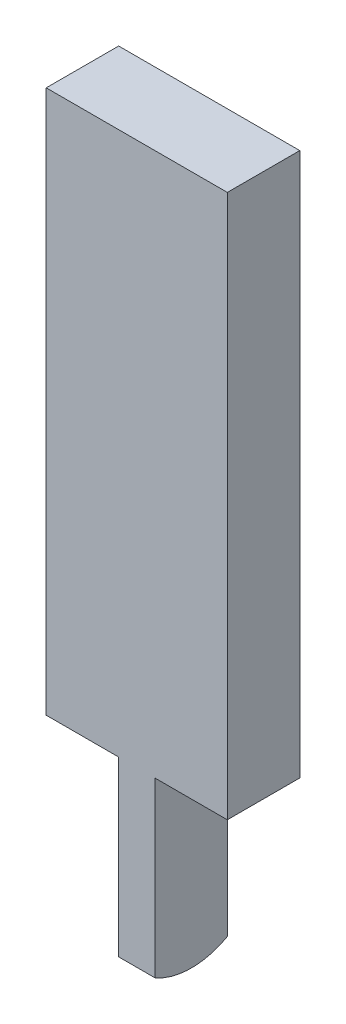
ISO-10303-21;
HEADER;
FILE_DESCRIPTION(('STEP AP214'),'2;1');
FILE_NAME('part.step','',(''),(''),'','','');
FILE_SCHEMA(('AUTOMOTIVE_DESIGN { 1 0 10303 214 1 1 1 1 }'));
ENDSEC;
DATA;
#1=APPLICATION_CONTEXT('core data for automotive mechanical design processes');
#2=APPLICATION_PROTOCOL_DEFINITION('international standard','automotive_design',2000,#1);
#3=PRODUCT_CONTEXT('',#1,'mechanical');
#4=PRODUCT('Part','Part','',(#3));
#5=PRODUCT_RELATED_PRODUCT_CATEGORY('part','',(#4));
#6=PRODUCT_DEFINITION_FORMATION('','',#4);
#7=PRODUCT_DEFINITION_CONTEXT('part definition',#1,'design');
#8=PRODUCT_DEFINITION('design','',#6,#7);
#9=PRODUCT_DEFINITION_SHAPE('','',#8);
#10=(LENGTH_UNIT() NAMED_UNIT(*) SI_UNIT(.MILLI.,.METRE.));
#11=(NAMED_UNIT(*) PLANE_ANGLE_UNIT() SI_UNIT($,.RADIAN.));
#12=(NAMED_UNIT(*) SI_UNIT($,.STERADIAN.) SOLID_ANGLE_UNIT());
#13=UNCERTAINTY_MEASURE_WITH_UNIT(LENGTH_MEASURE(1.E-05),#10,'distance_accuracy_value','');
#14=(GEOMETRIC_REPRESENTATION_CONTEXT(3) GLOBAL_UNCERTAINTY_ASSIGNED_CONTEXT((#13)) GLOBAL_UNIT_ASSIGNED_CONTEXT((#10,
#11,#12)) REPRESENTATION_CONTEXT('',''));
#15=CARTESIAN_POINT('',(0.,0.,0.));
#16=DIRECTION('',(0.,0.,1.));
#17=DIRECTION('',(1.,0.,0.));
#18=AXIS2_PLACEMENT_3D('',#15,#16,#17);
#19=CARTESIAN_POINT('',(-16.035999999991,59.,30.5000000000014));
#20=DIRECTION('',(1.,0.,0.));
#21=DIRECTION('',(0.,0.,-1.));
#22=AXIS2_PLACEMENT_3D('',#19,#20,#21);
#23=PLANE('',#22);
#24=DIRECTION('',(0.,-1.,0.));
#25=VECTOR('',#24,1.);
#26=CARTESIAN_POINT('',(-16.035999999991,59.,30.5000000000014));
#27=LINE('',#26,#25);
#28=CARTESIAN_POINT('',(-16.035999999991,59.,30.5000000000014));
#29=VERTEX_POINT('',#28);
#30=CARTESIAN_POINT('',(-16.035999999991,54.2223290948569,30.5000000000014));
#31=VERTEX_POINT('',#30);
#32=EDGE_CURVE('E46',#29,#31,#27,.T.);
#33=ORIENTED_EDGE('',*,*,#32,.T.);
#34=CARTESIAN_POINT('',(-16.035999999991,56.,31.5));
#35=DIRECTION('',(-1.,0.,0.));
#36=DIRECTION('',(0.,0.,1.));
#37=AXIS2_PLACEMENT_3D('',#34,#35,#36);
#38=CIRCLE('',#37,2.03963571428571);
#39=CARTESIAN_POINT('',(-16.035999999991,54.2223290948584,32.5000000000014));
#40=VERTEX_POINT('',#39);
#41=EDGE_CURVE('E156',#31,#40,#38,.T.);
#42=ORIENTED_EDGE('',*,*,#41,.T.);
#43=DIRECTION('',(0.,-1.,0.));
#44=VECTOR('',#43,1.);
#45=CARTESIAN_POINT('',(-16.035999999991,59.,32.5000000000014));
#46=LINE('',#45,#44);
#47=CARTESIAN_POINT('',(-16.035999999991,59.,32.5000000000014));
#48=VERTEX_POINT('',#47);
#49=EDGE_CURVE('E11',#48,#40,#46,.T.);
#50=ORIENTED_EDGE('',*,*,#49,.F.);
#51=DIRECTION('',(0.,0.,1.));
#52=VECTOR('',#51,1.);
#53=CARTESIAN_POINT('',(-16.035999999991,59.,30.5000000000014));
#54=LINE('',#53,#52);
#55=EDGE_CURVE('E152',#29,#48,#54,.T.);
#56=ORIENTED_EDGE('',*,*,#55,.F.);
#57=EDGE_LOOP('',(#33,#42,#50,#56));
#58=FACE_BOUND('',#57,.T.);
#59=ADVANCED_FACE('F30',(#58),#23,.F.);
#60=CARTESIAN_POINT('',(-16.035999999991,59.,32.5000000000014));
#61=DIRECTION('',(0.,0.,-1.));
#62=DIRECTION('',(-1.,0.,0.));
#63=AXIS2_PLACEMENT_3D('',#60,#61,#62);
#64=PLANE('',#63);
#65=ORIENTED_EDGE('',*,*,#49,.T.);
#66=DIRECTION('',(1.,0.,0.));
#67=VECTOR('',#66,1.);
#68=CARTESIAN_POINT('',(-87.9357266871828,54.2223290948584,32.5000000000014));
#69=LINE('',#68,#67);
#70=CARTESIAN_POINT('',(-15.0180000000031,54.2223290948584,32.5000000000014));
#71=VERTEX_POINT('',#70);
#72=EDGE_CURVE('E119',#40,#71,#69,.T.);
#73=ORIENTED_EDGE('',*,*,#72,.T.);
#74=DIRECTION('',(0.,-1.,0.));
#75=VECTOR('',#74,1.);
#76=CARTESIAN_POINT('',(-15.0180000000031,59.,32.5000000000014));
#77=LINE('',#76,#75);
#78=CARTESIAN_POINT('',(-15.0180000000031,59.,32.5000000000014));
#79=VERTEX_POINT('',#78);
#80=EDGE_CURVE('E38',#79,#71,#77,.T.);
#81=ORIENTED_EDGE('',*,*,#80,.F.);
#82=DIRECTION('',(1.,0.,0.));
#83=VECTOR('',#82,1.);
#84=CARTESIAN_POINT('',(-18.026999999997,59.,32.5000000000014));
#85=LINE('',#84,#83);
#86=CARTESIAN_POINT('',(-13.026999999997,59.,32.5000000000014));
#87=VERTEX_POINT('',#86);
#88=EDGE_CURVE('E150',#79,#87,#85,.T.);
#89=ORIENTED_EDGE('',*,*,#88,.T.);
#90=DIRECTION('',(0.,-1.,0.));
#91=VECTOR('',#90,1.);
#92=CARTESIAN_POINT('',(-13.026999999997,74.,32.5000000000014));
#93=LINE('',#92,#91);
#94=CARTESIAN_POINT('',(-13.026999999997,74.,32.5000000000014));
#95=VERTEX_POINT('',#94);
#96=EDGE_CURVE('E101',#95,#87,#93,.T.);
#97=ORIENTED_EDGE('',*,*,#96,.F.);
#98=DIRECTION('',(1.,0.,0.));
#99=VECTOR('',#98,1.);
#100=CARTESIAN_POINT('',(-18.026999999997,74.,32.5000000000014));
#101=LINE('',#100,#99);
#102=CARTESIAN_POINT('',(-18.026999999997,74.,32.5000000000014));
#103=VERTEX_POINT('',#102);
#104=EDGE_CURVE('E93',#103,#95,#101,.T.);
#105=ORIENTED_EDGE('',*,*,#104,.F.);
#106=DIRECTION('',(0.,-1.,0.));
#107=VECTOR('',#106,1.);
#108=CARTESIAN_POINT('',(-18.026999999997,74.,32.5000000000014));
#109=LINE('',#108,#107);
#110=CARTESIAN_POINT('',(-18.026999999997,59.,32.5000000000014));
#111=VERTEX_POINT('',#110);
#112=EDGE_CURVE('E98',#103,#111,#109,.T.);
#113=ORIENTED_EDGE('',*,*,#112,.T.);
#114=EDGE_CURVE('E178',#111,#48,#85,.T.);
#115=ORIENTED_EDGE('',*,*,#114,.T.);
#116=EDGE_LOOP('',(#65,#73,#81,#89,#97,#105,#113,#115));
#117=FACE_BOUND('',#116,.T.);
#118=ADVANCED_FACE('F95',(#117),#64,.F.);
#119=CARTESIAN_POINT('',(-15.0180000000031,59.,30.5000000000014));
#120=DIRECTION('',(-1.,0.,0.));
#121=DIRECTION('',(0.,0.,1.));
#122=AXIS2_PLACEMENT_3D('',#119,#120,#121);
#123=PLANE('',#122);
#124=ORIENTED_EDGE('',*,*,#80,.T.);
#125=CARTESIAN_POINT('',(-15.0180000000031,56.,31.5));
#126=DIRECTION('',(1.,0.,0.));
#127=DIRECTION('',(0.,0.,-1.));
#128=AXIS2_PLACEMENT_3D('',#125,#126,#127);
#129=CIRCLE('',#128,2.03963571428571);
#130=CARTESIAN_POINT('',(-15.0180000000031,54.2223290948569,30.5000000000014));
#131=VERTEX_POINT('',#130);
#132=EDGE_CURVE('E121',#71,#131,#129,.T.);
#133=ORIENTED_EDGE('',*,*,#132,.T.);
#134=DIRECTION('',(0.,-1.,0.));
#135=VECTOR('',#134,1.);
#136=CARTESIAN_POINT('',(-15.0180000000031,59.,30.5000000000014));
#137=LINE('',#136,#135);
#138=CARTESIAN_POINT('',(-15.0180000000031,59.,30.5000000000014));
#139=VERTEX_POINT('',#138);
#140=EDGE_CURVE('E154',#139,#131,#137,.T.);
#141=ORIENTED_EDGE('',*,*,#140,.F.);
#142=DIRECTION('',(0.,0.,-1.));
#143=VECTOR('',#142,1.);
#144=CARTESIAN_POINT('',(-15.0180000000031,59.,30.5000000000014));
#145=LINE('',#144,#143);
#146=EDGE_CURVE('E149',#79,#139,#145,.T.);
#147=ORIENTED_EDGE('',*,*,#146,.F.);
#148=EDGE_LOOP('',(#124,#133,#141,#147));
#149=FACE_BOUND('',#148,.T.);
#150=ADVANCED_FACE('F171',(#149),#123,.F.);
#151=CARTESIAN_POINT('',(-16.035999999991,59.,30.5000000000014));
#152=DIRECTION('',(0.,0.,1.));
#153=DIRECTION('',(1.,0.,0.));
#154=AXIS2_PLACEMENT_3D('',#151,#152,#153);
#155=PLANE('',#154);
#156=ORIENTED_EDGE('',*,*,#140,.T.);
#157=DIRECTION('',(1.,0.,0.));
#158=VECTOR('',#157,1.);
#159=CARTESIAN_POINT('',(-87.9357266871828,54.2223290948569,30.5000000000014));
#160=LINE('',#159,#158);
#161=EDGE_CURVE('E177',#131,#31,#160,.F.);
#162=ORIENTED_EDGE('',*,*,#161,.T.);
#163=ORIENTED_EDGE('',*,*,#32,.F.);
#164=DIRECTION('',(-1.,0.,0.));
#165=VECTOR('',#164,1.);
#166=CARTESIAN_POINT('',(-18.026999999997,59.,30.5000000000014));
#167=LINE('',#166,#165);
#168=CARTESIAN_POINT('',(-18.026999999997,59.,30.5000000000014));
#169=VERTEX_POINT('',#168);
#170=EDGE_CURVE('E130',#29,#169,#167,.T.);
#171=ORIENTED_EDGE('',*,*,#170,.T.);
#172=DIRECTION('',(0.,-1.,0.));
#173=VECTOR('',#172,1.);
#174=CARTESIAN_POINT('',(-18.026999999997,74.,30.5000000000014));
#175=LINE('',#174,#173);
#176=CARTESIAN_POINT('',(-18.026999999997,74.,30.5000000000014));
#177=VERTEX_POINT('',#176);
#178=EDGE_CURVE('E137',#177,#169,#175,.T.);
#179=ORIENTED_EDGE('',*,*,#178,.F.);
#180=DIRECTION('',(-1.,0.,0.));
#181=VECTOR('',#180,1.);
#182=CARTESIAN_POINT('',(-18.026999999997,74.,30.5000000000014));
#183=LINE('',#182,#181);
#184=CARTESIAN_POINT('',(-13.026999999997,74.,30.5000000000014));
#185=VERTEX_POINT('',#184);
#186=EDGE_CURVE('E110',#185,#177,#183,.T.);
#187=ORIENTED_EDGE('',*,*,#186,.F.);
#188=DIRECTION('',(0.,-1.,0.));
#189=VECTOR('',#188,1.);
#190=CARTESIAN_POINT('',(-13.026999999997,74.,30.5000000000014));
#191=LINE('',#190,#189);
#192=CARTESIAN_POINT('',(-13.026999999997,59.,30.5000000000014));
#193=VERTEX_POINT('',#192);
#194=EDGE_CURVE('E123',#185,#193,#191,.T.);
#195=ORIENTED_EDGE('',*,*,#194,.T.);
#196=EDGE_CURVE('E114',#193,#139,#167,.T.);
#197=ORIENTED_EDGE('',*,*,#196,.T.);
#198=EDGE_LOOP('',(#156,#162,#163,#171,#179,#187,#195,#197));
#199=FACE_BOUND('',#198,.T.);
#200=ADVANCED_FACE('F142',(#199),#155,.F.);
#201=CARTESIAN_POINT('',(-87.9357266871828,56.,31.5));
#202=DIRECTION('',(1.,0.,0.));
#203=DIRECTION('',(0.,0.,1.));
#204=AXIS2_PLACEMENT_3D('',#201,#202,#203);
#205=CYLINDRICAL_SURFACE('',#204,2.03963571428571);
#206=ORIENTED_EDGE('',*,*,#41,.F.);
#207=ORIENTED_EDGE('',*,*,#161,.F.);
#208=ORIENTED_EDGE('',*,*,#132,.F.);
#209=ORIENTED_EDGE('',*,*,#72,.F.);
#210=EDGE_LOOP('',(#206,#207,#208,#209));
#211=FACE_BOUND('',#210,.T.);
#212=ADVANCED_FACE('F175',(#211),#205,.T.);
#213=CARTESIAN_POINT('',(-18.026999999997,59.,32.5000000000014));
#214=DIRECTION('',(0.,1.,0.));
#215=DIRECTION('',(0.,0.,1.));
#216=AXIS2_PLACEMENT_3D('',#213,#214,#215);
#217=PLANE('',#216);
#218=ORIENTED_EDGE('',*,*,#170,.F.);
#219=ORIENTED_EDGE('',*,*,#55,.T.);
#220=ORIENTED_EDGE('',*,*,#114,.F.);
#221=DIRECTION('',(0.,0.,1.));
#222=VECTOR('',#221,1.);
#223=CARTESIAN_POINT('',(-18.026999999997,59.,30.5000000000014));
#224=LINE('',#223,#222);
#225=EDGE_CURVE('E118',#169,#111,#224,.T.);
#226=ORIENTED_EDGE('',*,*,#225,.F.);
#227=EDGE_LOOP('',(#218,#219,#220,#226));
#228=FACE_BOUND('',#227,.T.);
#229=ADVANCED_FACE('F182',(#228),#217,.F.);
#230=ORIENTED_EDGE('',*,*,#88,.F.);
#231=ORIENTED_EDGE('',*,*,#146,.T.);
#232=ORIENTED_EDGE('',*,*,#196,.F.);
#233=DIRECTION('',(0.,0.,-1.));
#234=VECTOR('',#233,1.);
#235=CARTESIAN_POINT('',(-13.026999999997,59.,30.5000000000014));
#236=LINE('',#235,#234);
#237=EDGE_CURVE('E135',#87,#193,#236,.T.);
#238=ORIENTED_EDGE('',*,*,#237,.F.);
#239=EDGE_LOOP('',(#230,#231,#232,#238));
#240=FACE_BOUND('',#239,.T.);
#241=ADVANCED_FACE('F148',(#240),#217,.F.);
#242=CARTESIAN_POINT('',(-18.026999999997,74.,30.5000000000014));
#243=DIRECTION('',(1.,0.,0.));
#244=DIRECTION('',(0.,0.,-1.));
#245=AXIS2_PLACEMENT_3D('',#242,#243,#244);
#246=PLANE('',#245);
#247=ORIENTED_EDGE('',*,*,#225,.T.);
#248=ORIENTED_EDGE('',*,*,#112,.F.);
#249=DIRECTION('',(0.,0.,1.));
#250=VECTOR('',#249,1.);
#251=CARTESIAN_POINT('',(-18.026999999997,74.,30.5000000000014));
#252=LINE('',#251,#250);
#253=EDGE_CURVE('E105',#177,#103,#252,.T.);
#254=ORIENTED_EDGE('',*,*,#253,.F.);
#255=ORIENTED_EDGE('',*,*,#178,.T.);
#256=EDGE_LOOP('',(#247,#248,#254,#255));
#257=FACE_BOUND('',#256,.T.);
#258=ADVANCED_FACE('F116',(#257),#246,.F.);
#259=CARTESIAN_POINT('',(-13.026999999997,74.,30.5000000000014));
#260=DIRECTION('',(-1.,0.,0.));
#261=DIRECTION('',(0.,0.,1.));
#262=AXIS2_PLACEMENT_3D('',#259,#260,#261);
#263=PLANE('',#262);
#264=ORIENTED_EDGE('',*,*,#237,.T.);
#265=ORIENTED_EDGE('',*,*,#194,.F.);
#266=DIRECTION('',(0.,0.,-1.));
#267=VECTOR('',#266,1.);
#268=CARTESIAN_POINT('',(-13.026999999997,74.,30.5000000000014));
#269=LINE('',#268,#267);
#270=EDGE_CURVE('E104',#95,#185,#269,.T.);
#271=ORIENTED_EDGE('',*,*,#270,.F.);
#272=ORIENTED_EDGE('',*,*,#96,.T.);
#273=EDGE_LOOP('',(#264,#265,#271,#272));
#274=FACE_BOUND('',#273,.T.);
#275=ADVANCED_FACE('F189',(#274),#263,.F.);
#276=CARTESIAN_POINT('',(-18.026999999997,74.,32.5000000000014));
#277=DIRECTION('',(0.,1.,0.));
#278=DIRECTION('',(0.,0.,1.));
#279=AXIS2_PLACEMENT_3D('',#276,#277,#278);
#280=PLANE('',#279);
#281=ORIENTED_EDGE('',*,*,#253,.T.);
#282=ORIENTED_EDGE('',*,*,#104,.T.);
#283=ORIENTED_EDGE('',*,*,#270,.T.);
#284=ORIENTED_EDGE('',*,*,#186,.T.);
#285=EDGE_LOOP('',(#281,#282,#283,#284));
#286=FACE_BOUND('',#285,.T.);
#287=ADVANCED_FACE('F108',(#286),#280,.T.);
#288=CLOSED_SHELL('',(#59,#118,#150,#200,#212,#229,#241,#258,#275,#287));
#289=MANIFOLD_SOLID_BREP('B2',#288);
#290=ADVANCED_BREP_SHAPE_REPRESENTATION('',(#18,#289),#14);
#291=SHAPE_DEFINITION_REPRESENTATION(#9,#290);
ENDSEC;
END-ISO-10303-21;
